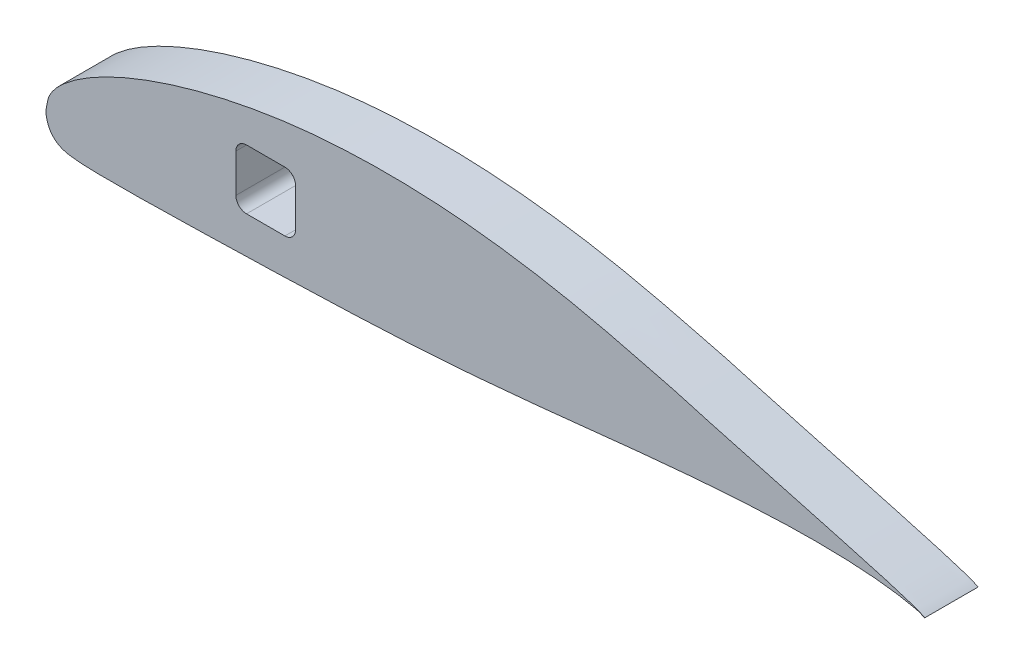
ISO-10303-21;
HEADER;
FILE_DESCRIPTION(('STEP AP214'),'2;1');
FILE_NAME('part.step','',(''),(''),'','','');
FILE_SCHEMA(('AUTOMOTIVE_DESIGN { 1 0 10303 214 1 1 1 1 }'));
ENDSEC;
DATA;
#1=APPLICATION_CONTEXT('core data for automotive mechanical design processes');
#2=APPLICATION_PROTOCOL_DEFINITION('international standard','automotive_design',2000,#1);
#3=PRODUCT_CONTEXT('',#1,'mechanical');
#4=PRODUCT('Part','Part','',(#3));
#5=PRODUCT_RELATED_PRODUCT_CATEGORY('part','',(#4));
#6=PRODUCT_DEFINITION_FORMATION('','',#4);
#7=PRODUCT_DEFINITION_CONTEXT('part definition',#1,'design');
#8=PRODUCT_DEFINITION('design','',#6,#7);
#9=PRODUCT_DEFINITION_SHAPE('','',#8);
#10=(LENGTH_UNIT() NAMED_UNIT(*) SI_UNIT(.MILLI.,.METRE.));
#11=(NAMED_UNIT(*) PLANE_ANGLE_UNIT() SI_UNIT($,.RADIAN.));
#12=(NAMED_UNIT(*) SI_UNIT($,.STERADIAN.) SOLID_ANGLE_UNIT());
#13=UNCERTAINTY_MEASURE_WITH_UNIT(LENGTH_MEASURE(1.E-05),#10,'distance_accuracy_value','');
#14=(GEOMETRIC_REPRESENTATION_CONTEXT(3) GLOBAL_UNCERTAINTY_ASSIGNED_CONTEXT((#13)) GLOBAL_UNIT_ASSIGNED_CONTEXT((#10,
#11,#12)) REPRESENTATION_CONTEXT('',''));
#15=CARTESIAN_POINT('',(0.,0.,0.));
#16=DIRECTION('',(0.,0.,1.));
#17=DIRECTION('',(1.,0.,0.));
#18=AXIS2_PLACEMENT_3D('',#15,#16,#17);
#19=CARTESIAN_POINT('',(113.919,28.5109385218788,25.4));
#20=DIRECTION('',(0.,0.,-1.));
#21=DIRECTION('',(-1.,0.,0.));
#22=AXIS2_PLACEMENT_3D('',#19,#20,#21);
#23=CYLINDRICAL_SURFACE('',#22,5.08);
#24=CARTESIAN_POINT('',(113.919,28.5109385218788,0.));
#25=DIRECTION('',(0.,0.,1.));
#26=DIRECTION('',(1.,0.,0.));
#27=AXIS2_PLACEMENT_3D('',#24,#25,#26);
#28=CIRCLE('',#27,5.08);
#29=CARTESIAN_POINT('',(118.999,28.5109385218788,0.));
#30=VERTEX_POINT('',#29);
#31=CARTESIAN_POINT('',(113.919,33.5909385218788,0.));
#32=VERTEX_POINT('',#31);
#33=EDGE_CURVE('E224',#30,#32,#28,.T.);
#34=ORIENTED_EDGE('',*,*,#33,.F.);
#35=DIRECTION('',(0.,0.,-1.));
#36=VECTOR('',#35,1.);
#37=CARTESIAN_POINT('',(118.999,28.5109385218788,25.4));
#38=LINE('',#37,#36);
#39=CARTESIAN_POINT('',(118.999,28.5109385218788,25.4));
#40=VERTEX_POINT('',#39);
#41=EDGE_CURVE('E12',#40,#30,#38,.T.);
#42=ORIENTED_EDGE('',*,*,#41,.F.);
#43=CARTESIAN_POINT('',(113.919,28.5109385218788,25.4));
#44=DIRECTION('',(0.,0.,1.));
#45=DIRECTION('',(1.,0.,0.));
#46=AXIS2_PLACEMENT_3D('',#43,#44,#45);
#47=CIRCLE('',#46,5.08);
#48=CARTESIAN_POINT('',(113.919,33.5909385218788,25.4));
#49=VERTEX_POINT('',#48);
#50=EDGE_CURVE('E289',#40,#49,#47,.T.);
#51=ORIENTED_EDGE('',*,*,#50,.T.);
#52=DIRECTION('',(0.,0.,-1.));
#53=VECTOR('',#52,1.);
#54=CARTESIAN_POINT('',(113.919,33.5909385218788,25.4));
#55=LINE('',#54,#53);
#56=EDGE_CURVE('E140',#49,#32,#55,.T.);
#57=ORIENTED_EDGE('',*,*,#56,.T.);
#58=EDGE_LOOP('',(#34,#42,#51,#57));
#59=FACE_BOUND('',#58,.T.);
#60=ADVANCED_FACE('F124',(#59),#23,.F.);
#61=CARTESIAN_POINT('',(0.,0.,0.));
#62=DIRECTION('',(0.,0.,1.));
#63=DIRECTION('',(1.,0.,0.));
#64=AXIS2_PLACEMENT_3D('',#61,#62,#63);
#65=PLANE('',#64);
#66=ORIENTED_EDGE('',*,*,#33,.T.);
#67=DIRECTION('',(-1.,0.,0.));
#68=VECTOR('',#67,1.);
#69=CARTESIAN_POINT('',(0.,33.5909385218788,0.));
#70=LINE('',#69,#68);
#71=CARTESIAN_POINT('',(95.631,33.5909385218788,0.));
#72=VERTEX_POINT('',#71);
#73=EDGE_CURVE('E282',#32,#72,#70,.T.);
#74=ORIENTED_EDGE('',*,*,#73,.T.);
#75=CARTESIAN_POINT('',(95.631,28.5109385218788,0.));
#76=DIRECTION('',(0.,0.,1.));
#77=DIRECTION('',(1.,0.,0.));
#78=AXIS2_PLACEMENT_3D('',#75,#76,#77);
#79=CIRCLE('',#78,5.08);
#80=CARTESIAN_POINT('',(90.551,28.5109385218788,0.));
#81=VERTEX_POINT('',#80);
#82=EDGE_CURVE('E280',#72,#81,#79,.T.);
#83=ORIENTED_EDGE('',*,*,#82,.T.);
#84=DIRECTION('',(0.,-1.,0.));
#85=VECTOR('',#84,1.);
#86=CARTESIAN_POINT('',(90.551,0.,0.));
#87=LINE('',#86,#85);
#88=CARTESIAN_POINT('',(90.551,10.2229385218788,0.));
#89=VERTEX_POINT('',#88);
#90=EDGE_CURVE('E195',#81,#89,#87,.T.);
#91=ORIENTED_EDGE('',*,*,#90,.T.);
#92=CARTESIAN_POINT('',(95.631,10.2229385218788,0.));
#93=DIRECTION('',(0.,0.,1.));
#94=DIRECTION('',(1.,0.,0.));
#95=AXIS2_PLACEMENT_3D('',#92,#93,#94);
#96=CIRCLE('',#95,5.08);
#97=CARTESIAN_POINT('',(95.631,5.14293852187881,0.));
#98=VERTEX_POINT('',#97);
#99=EDGE_CURVE('E276',#89,#98,#96,.T.);
#100=ORIENTED_EDGE('',*,*,#99,.T.);
#101=DIRECTION('',(-1.,0.,0.));
#102=VECTOR('',#101,1.);
#103=CARTESIAN_POINT('',(0.,5.14293852187881,0.));
#104=LINE('',#103,#102);
#105=CARTESIAN_POINT('',(113.919,5.14293852187881,0.));
#106=VERTEX_POINT('',#105);
#107=EDGE_CURVE('E271',#106,#98,#104,.T.);
#108=ORIENTED_EDGE('',*,*,#107,.F.);
#109=CARTESIAN_POINT('',(113.919,10.2229385218788,0.));
#110=DIRECTION('',(0.,0.,1.));
#111=DIRECTION('',(1.,0.,0.));
#112=AXIS2_PLACEMENT_3D('',#109,#110,#111);
#113=CIRCLE('',#112,5.08);
#114=CARTESIAN_POINT('',(118.999,10.2229385218788,0.));
#115=VERTEX_POINT('',#114);
#116=EDGE_CURVE('E268',#115,#106,#113,.F.);
#117=ORIENTED_EDGE('',*,*,#116,.F.);
#118=DIRECTION('',(0.,-1.,0.));
#119=VECTOR('',#118,1.);
#120=CARTESIAN_POINT('',(118.999,0.,0.));
#121=LINE('',#120,#119);
#122=EDGE_CURVE('E267',#30,#115,#121,.T.);
#123=ORIENTED_EDGE('',*,*,#122,.F.);
#124=EDGE_LOOP('',(#66,#74,#83,#91,#100,#108,#117,#123));
#125=FACE_BOUND('',#124,.T.);
#126=CARTESIAN_POINT('',(419.1,0.,0.));
#127=CARTESIAN_POINT('',(419.135582715604,0.0308317196044877,0.));
#128=CARTESIAN_POINT('',(415.908005576762,1.68017552922438,0.));
#129=CARTESIAN_POINT('',(413.243760321431,2.45449325102642,0.));
#130=CARTESIAN_POINT('',(409.043286393216,3.88399929072975,0.));
#131=CARTESIAN_POINT('',(404.448084399841,5.26468352260066,0.));
#132=CARTESIAN_POINT('',(399.073048504437,6.84672085309653,0.));
#133=CARTESIAN_POINT('',(393.069943473864,8.55383071372093,0.));
#134=CARTESIAN_POINT('',(386.416537762572,10.4125623702694,0.));
#135=CARTESIAN_POINT('',(379.149346257583,12.4152401973134,0.));
#136=CARTESIAN_POINT('',(371.290373604248,14.5663386528226,0.));
#137=CARTESIAN_POINT('',(362.867607833606,16.8600771410093,0.));
#138=CARTESIAN_POINT('',(353.911264701423,19.2970964213392,0.));
#139=CARTESIAN_POINT('',(344.453150457147,21.8730071850554,0.));
#140=CARTESIAN_POINT('',(334.523432326998,24.5698824655877,0.));
#141=CARTESIAN_POINT('',(324.169303454509,27.4216021936468,0.));
#142=CARTESIAN_POINT('',(313.362731470659,30.2499142733887,0.));
#143=CARTESIAN_POINT('',(302.362905014892,33.694567181203,0.));
#144=CARTESIAN_POINT('',(290.812066152157,36.3225036594668,0.));
#145=CARTESIAN_POINT('',(279.147802785444,39.4898304897028,0.));
#146=CARTESIAN_POINT('',(267.18702760258,42.4092459803584,0.));
#147=CARTESIAN_POINT('',(255.034690470087,45.1684284186771,0.));
#148=CARTESIAN_POINT('',(242.721185390446,47.650209376373,0.));
#149=CARTESIAN_POINT('',(230.296228943543,49.8338945911509,0.));
#150=CARTESIAN_POINT('',(217.801864374593,51.6800065771285,0.));
#151=CARTESIAN_POINT('',(205.28400048705,53.175668630729,0.));
#152=CARTESIAN_POINT('',(192.786307767397,54.3071055161748,0.));
#153=CARTESIAN_POINT('',(180.35248832563,55.0551537512211,0.));
#154=CARTESIAN_POINT('',(168.027001927048,55.4190185344547,0.));
#155=CARTESIAN_POINT('',(155.853682433519,55.4157048874246,0.));
#156=CARTESIAN_POINT('',(143.874848820048,55.0431886057995,0.));
#157=CARTESIAN_POINT('',(132.132886757781,54.3128726201629,0.));
#158=CARTESIAN_POINT('',(120.667074019597,53.2411304735398,0.));
#159=CARTESIAN_POINT('',(109.522615963792,51.8022144959764,0.));
#160=CARTESIAN_POINT('',(98.7372141186955,50.0463241889842,0.));
#161=CARTESIAN_POINT('',(88.3471013961049,48.018984454137,0.));
#162=CARTESIAN_POINT('',(78.3889033747344,45.7522950434563,0.));
#163=CARTESIAN_POINT('',(68.8976027410483,43.2760726247493,0.));
#164=CARTESIAN_POINT('',(59.9067725274482,40.6169839418443,0.));
#165=CARTESIAN_POINT('',(51.4478081121291,37.8028434738782,0.));
#166=CARTESIAN_POINT('',(43.5499195166549,34.8620258650089,0.));
#167=CARTESIAN_POINT('',(36.2412767191211,31.8209315950195,0.));
#168=CARTESIAN_POINT('',(29.5472205514253,28.7079086552229,0.));
#169=CARTESIAN_POINT('',(23.4899755011858,25.5532333371454,0.));
#170=CARTESIAN_POINT('',(18.0911782238622,22.3841442181796,0.));
#171=CARTESIAN_POINT('',(13.3658843805296,19.2305326996037,0.));
#172=CARTESIAN_POINT('',(9.3302502078457,16.1138179845186,0.));
#173=CARTESIAN_POINT('',(5.96985195064272,13.0389997626468,0.));
#174=CARTESIAN_POINT('',(3.34519775435926,9.93858431084437,0.));
#175=CARTESIAN_POINT('',(1.18019279694968,6.53570814186339,0.));
#176=CARTESIAN_POINT('',(0.479614476084666,3.07990840614629,0.));
#177=CARTESIAN_POINT('',(-0.173094538194013,-0.266173519096999,0.));
#178=CARTESIAN_POINT('',(0.240253696731487,-3.33294292892219,0.));
#179=CARTESIAN_POINT('',(1.37823066344816,-6.42381349893486,0.));
#180=CARTESIAN_POINT('',(3.22917605316422,-9.15021189114401,0.));
#181=CARTESIAN_POINT('',(5.89603945867697,-11.3206783893859,0.));
#182=CARTESIAN_POINT('',(9.37076014042797,-12.5914230643237,0.));
#183=CARTESIAN_POINT('',(13.453435798726,-13.2083059619907,0.));
#184=CARTESIAN_POINT('',(18.1779423005279,-13.5437135880216,0.));
#185=CARTESIAN_POINT('',(23.5691170669731,-13.7123319803595,0.));
#186=CARTESIAN_POINT('',(29.6182619801359,-13.823243232534,0.));
#187=CARTESIAN_POINT('',(36.3042180587839,-13.6335103430087,0.));
#188=CARTESIAN_POINT('',(43.6073655350185,-13.7495169210751,0.));
#189=CARTESIAN_POINT('',(51.4990776759717,-13.5704792834039,0.));
#190=CARTESIAN_POINT('',(59.9532183473222,-13.4254465725169,0.));
#191=CARTESIAN_POINT('',(68.9395115321997,-13.2237173628326,0.));
#192=CARTESIAN_POINT('',(78.4265430004961,-12.9981677083409,0.));
#193=CARTESIAN_POINT('',(88.3808800346853,-12.7416794666378,0.));
#194=CARTESIAN_POINT('',(98.7673540895394,-12.4570310641555,0.));
#195=CARTESIAN_POINT('',(109.54948172432,-12.140459652531,0.));
#196=CARTESIAN_POINT('',(120.689292624668,-11.7887582713286,0.));
#197=CARTESIAN_POINT('',(132.147836588957,-11.3961109222143,0.));
#198=CARTESIAN_POINT('',(143.884459540584,-10.9535138146728,0.));
#199=CARTESIAN_POINT('',(155.858263106315,-10.4528030476575,0.));
#200=CARTESIAN_POINT('',(168.027206140478,-9.86999068905553,0.));
#201=CARTESIAN_POINT('',(180.347887972849,-9.165777546511,0.));
#202=CARTESIAN_POINT('',(192.776520036076,-8.32898473292583,0.));
#203=CARTESIAN_POINT('',(205.26997993133,-7.36712520311923,0.));
#204=CARTESIAN_POINT('',(217.78370517201,-6.28359723526979,0.));
#205=CARTESIAN_POINT('',(230.27340567155,-5.08810592291552,0.));
#206=CARTESIAN_POINT('',(242.694431579561,-3.80572861400042,0.));
#207=CARTESIAN_POINT('',(255.00369846204,-2.48473779902352,0.));
#208=CARTESIAN_POINT('',(267.1595145786,-1.18392896216685,0.));
#209=CARTESIAN_POINT('',(279.118910189508,0.0608541103189656,0.));
#210=CARTESIAN_POINT('',(290.839416131453,1.22547415877869,0.));
#211=CARTESIAN_POINT('',(302.279388868877,2.28931437619538,0.));
#212=CARTESIAN_POINT('',(313.398970817434,3.22922123297632,0.));
#213=CARTESIAN_POINT('',(324.158839538699,4.03315524687126,0.));
#214=CARTESIAN_POINT('',(334.521417810108,4.68459136287556,0.));
#215=CARTESIAN_POINT('',(344.449906703923,5.17915941725161,0.));
#216=CARTESIAN_POINT('',(353.909457193007,5.50145282981024,0.));
#217=CARTESIAN_POINT('',(362.866468874944,5.68255660990501,0.));
#218=CARTESIAN_POINT('',(371.289861146006,5.66136185236058,0.));
#219=CARTESIAN_POINT('',(379.150044793554,5.50730755128629,0.));
#220=CARTESIAN_POINT('',(386.41801209807,5.19545299038324,0.));
#221=CARTESIAN_POINT('',(393.072269135646,4.74663009471408,0.));
#222=CARTESIAN_POINT('',(399.076807101172,4.17945925926168,0.));
#223=CARTESIAN_POINT('',(404.450455267835,3.48998403896945,0.));
#224=CARTESIAN_POINT('',(409.051278482858,2.78398441205405,0.));
#225=CARTESIAN_POINT('',(413.236952463653,1.83700723232058,0.));
#226=CARTESIAN_POINT('',(415.921101733839,1.37110704301137,0.));
#227=CARTESIAN_POINT('',(419.065830525278,-0.029607174319721,0.));
#228=CARTESIAN_POINT('',(419.1,0.,0.));
#229=B_SPLINE_CURVE_WITH_KNOTS('',3,(#126,#127,#128,#129,#130,#131,#132,#133,#134,#135,#136,
#137,#138,#139,#140,#141,#142,#143,#144,#145,#146,#147,#148,#149,#150,#151,#152,#153,#154,#155,
#156,#157,#158,#159,#160,#161,#162,#163,#164,#165,#166,#167,#168,#169,#170,#171,#172,#173,#174,
#175,#176,#177,#178,#179,#180,#181,#182,#183,#184,#185,#186,#187,#188,#189,#190,#191,#192,#193,
#194,#195,#196,#197,#198,#199,#200,#201,#202,#203,#204,#205,#206,#207,#208,#209,#210,#211,#212,
#213,#214,#215,#216,#217,#218,#219,#220,#221,#222,#223,#224,#225,#226,#227,#228),.UNSPECIFIED.,
.T.,.F.,(4,1,1,1,1,1,1,1,1,1,1,1,1,1,1,1,1,1,1,1,1,1,1,1,1,1,1,1,1,1,1,1,1,1,1,1,1,1,1,1,1,1,1,
1,1,1,1,1,1,1,1,1,1,1,1,1,1,1,1,1,1,1,1,1,1,1,1,1,1,1,1,1,1,1,1,1,1,1,1,1,1,1,1,1,1,1,1,1,1,1,1,
1,1,1,1,1,1,1,1,1,4),(0.,0.00326326473849562,0.00725055778081695,0.0120517866669423,
0.0176623330327685,0.0240683135255837,0.0312496964611172,0.0391846495195136,0.0478476383038653,
0.0572106956853794,0.0672423330052171,0.0779087597757613,0.0891739845115157,0.100998598535301,
0.113341295445461,0.126157183269471,0.139462308480939,0.15301104004999,0.166927614873976,
0.181081999654676,0.195404479567021,0.209838051098696,0.22433260533195,0.238841948726956,
0.253325072610518,0.267739981910177,0.282048685133404,0.296212776873056,0.310196042923521,
0.323962314217842,0.337476234648746,0.350702494836571,0.363610632106416,0.376163958841249,
0.388325705275646,0.400058825783343,0.411327389676265,0.422098222191528,0.43233946020634,
0.442020270803025,0.451113162537921,0.459592207108775,0.467434958693347,0.474622153537792,
0.481140130111015,0.486983093720853,0.492171114209171,0.496782496001346,0.500970225910245,
0.505871632390465,0.508789423353898,0.512670174112342,0.516325667709443,0.520069901737776,
0.523879651231969,0.52796074283848,0.532641784179838,0.53806925539385,0.544264221299989,
0.551214848194982,0.558899644744671,0.567291448215615,0.576362098792024,0.586079537161936,
0.59640911206805,0.607314709370189,0.618758331538551,0.630699137504577,0.643094929182506,
0.655903572744297,0.669079202119925,0.682576600267353,0.696348372587692,0.710348009169474,
0.724529115657972,0.738844326830719,0.753243364933569,0.767678182352391,0.782097111011908,
0.796448880119002,0.810678262943487,0.824728612910585,0.838547558662397,0.852083943216766,
0.865287848030887,0.878111787127333,0.890511304117214,0.902443005266515,0.913865891429004,
0.924742045614225,0.935035830895632,0.944714495449492,0.953747111862331,0.962105881416277,
0.969765452086777,0.97670305026236,0.982898839006144,0.988333205705569,0.992993711919812,
0.996866342545812,1.),.UNSPECIFIED.);
#230=CARTESIAN_POINT('',(419.1,0.,0.));
#231=VERTEX_POINT('',#230);
#232=EDGE_CURVE('E284',#231,#231,#229,.T.);
#233=ORIENTED_EDGE('',*,*,#232,.F.);
#234=EDGE_LOOP('',(#233));
#235=FACE_BOUND('',#234,.T.);
#236=ADVANCED_FACE('F236',(#125,#235),#65,.F.);
#237=CARTESIAN_POINT('',(118.999,0.,25.4));
#238=DIRECTION('',(1.,0.,0.));
#239=DIRECTION('',(0.,0.,-1.));
#240=AXIS2_PLACEMENT_3D('',#237,#238,#239);
#241=PLANE('',#240);
#242=ORIENTED_EDGE('',*,*,#122,.T.);
#243=DIRECTION('',(0.,0.,-1.));
#244=VECTOR('',#243,1.);
#245=CARTESIAN_POINT('',(118.999,10.2229385218788,25.4));
#246=LINE('',#245,#244);
#247=CARTESIAN_POINT('',(118.999,10.2229385218788,25.4));
#248=VERTEX_POINT('',#247);
#249=EDGE_CURVE('E132',#248,#115,#246,.T.);
#250=ORIENTED_EDGE('',*,*,#249,.F.);
#251=DIRECTION('',(0.,-1.,0.));
#252=VECTOR('',#251,1.);
#253=CARTESIAN_POINT('',(118.999,0.,25.4));
#254=LINE('',#253,#252);
#255=EDGE_CURVE('E311',#40,#248,#254,.T.);
#256=ORIENTED_EDGE('',*,*,#255,.F.);
#257=ORIENTED_EDGE('',*,*,#41,.T.);
#258=EDGE_LOOP('',(#242,#250,#256,#257));
#259=FACE_BOUND('',#258,.T.);
#260=ADVANCED_FACE('F254',(#259),#241,.F.);
#261=CARTESIAN_POINT('',(113.919,10.2229385218788,25.4));
#262=DIRECTION('',(0.,0.,-1.));
#263=DIRECTION('',(-1.,0.,0.));
#264=AXIS2_PLACEMENT_3D('',#261,#262,#263);
#265=CYLINDRICAL_SURFACE('',#264,5.08);
#266=ORIENTED_EDGE('',*,*,#116,.T.);
#267=DIRECTION('',(0.,0.,-1.));
#268=VECTOR('',#267,1.);
#269=CARTESIAN_POINT('',(113.919,5.14293852187881,25.4));
#270=LINE('',#269,#268);
#271=CARTESIAN_POINT('',(113.919,5.14293852187881,25.4));
#272=VERTEX_POINT('',#271);
#273=EDGE_CURVE('E298',#272,#106,#270,.T.);
#274=ORIENTED_EDGE('',*,*,#273,.F.);
#275=CARTESIAN_POINT('',(113.919,10.2229385218788,25.4));
#276=DIRECTION('',(0.,0.,1.));
#277=DIRECTION('',(1.,0.,0.));
#278=AXIS2_PLACEMENT_3D('',#275,#276,#277);
#279=CIRCLE('',#278,5.08);
#280=EDGE_CURVE('E303',#248,#272,#279,.F.);
#281=ORIENTED_EDGE('',*,*,#280,.F.);
#282=ORIENTED_EDGE('',*,*,#249,.T.);
#283=EDGE_LOOP('',(#266,#274,#281,#282));
#284=FACE_BOUND('',#283,.T.);
#285=ADVANCED_FACE('F251',(#284),#265,.F.);
#286=CARTESIAN_POINT('',(0.,5.14293852187881,25.4));
#287=DIRECTION('',(0.,-1.,0.));
#288=DIRECTION('',(1.,0.,0.));
#289=AXIS2_PLACEMENT_3D('',#286,#287,#288);
#290=PLANE('',#289);
#291=ORIENTED_EDGE('',*,*,#107,.T.);
#292=DIRECTION('',(0.,0.,-1.));
#293=VECTOR('',#292,1.);
#294=CARTESIAN_POINT('',(95.631,5.14293852187881,25.4));
#295=LINE('',#294,#293);
#296=CARTESIAN_POINT('',(95.631,5.14293852187881,25.4));
#297=VERTEX_POINT('',#296);
#298=EDGE_CURVE('E296',#297,#98,#295,.T.);
#299=ORIENTED_EDGE('',*,*,#298,.F.);
#300=DIRECTION('',(-1.,0.,0.));
#301=VECTOR('',#300,1.);
#302=CARTESIAN_POINT('',(0.,5.14293852187881,25.4));
#303=LINE('',#302,#301);
#304=EDGE_CURVE('E309',#272,#297,#303,.T.);
#305=ORIENTED_EDGE('',*,*,#304,.F.);
#306=ORIENTED_EDGE('',*,*,#273,.T.);
#307=EDGE_LOOP('',(#291,#299,#305,#306));
#308=FACE_BOUND('',#307,.T.);
#309=ADVANCED_FACE('F247',(#308),#290,.F.);
#310=CARTESIAN_POINT('',(95.631,10.2229385218788,25.4));
#311=DIRECTION('',(0.,0.,-1.));
#312=DIRECTION('',(-1.,0.,0.));
#313=AXIS2_PLACEMENT_3D('',#310,#311,#312);
#314=CYLINDRICAL_SURFACE('',#313,5.08);
#315=ORIENTED_EDGE('',*,*,#99,.F.);
#316=DIRECTION('',(0.,0.,-1.));
#317=VECTOR('',#316,1.);
#318=CARTESIAN_POINT('',(90.551,10.2229385218788,25.4));
#319=LINE('',#318,#317);
#320=CARTESIAN_POINT('',(90.551,10.2229385218788,25.4));
#321=VERTEX_POINT('',#320);
#322=EDGE_CURVE('E199',#321,#89,#319,.T.);
#323=ORIENTED_EDGE('',*,*,#322,.F.);
#324=CARTESIAN_POINT('',(95.631,10.2229385218788,25.4));
#325=DIRECTION('',(0.,0.,1.));
#326=DIRECTION('',(1.,0.,0.));
#327=AXIS2_PLACEMENT_3D('',#324,#325,#326);
#328=CIRCLE('',#327,5.08);
#329=EDGE_CURVE('E210',#321,#297,#328,.T.);
#330=ORIENTED_EDGE('',*,*,#329,.T.);
#331=ORIENTED_EDGE('',*,*,#298,.T.);
#332=EDGE_LOOP('',(#315,#323,#330,#331));
#333=FACE_BOUND('',#332,.T.);
#334=ADVANCED_FACE('F244',(#333),#314,.F.);
#335=CARTESIAN_POINT('',(90.551,0.,25.4));
#336=DIRECTION('',(1.,0.,0.));
#337=DIRECTION('',(0.,0.,-1.));
#338=AXIS2_PLACEMENT_3D('',#335,#336,#337);
#339=PLANE('',#338);
#340=ORIENTED_EDGE('',*,*,#90,.F.);
#341=DIRECTION('',(0.,0.,-1.));
#342=VECTOR('',#341,1.);
#343=CARTESIAN_POINT('',(90.551,28.5109385218788,25.4));
#344=LINE('',#343,#342);
#345=CARTESIAN_POINT('',(90.551,28.5109385218788,25.4));
#346=VERTEX_POINT('',#345);
#347=EDGE_CURVE('E190',#346,#81,#344,.T.);
#348=ORIENTED_EDGE('',*,*,#347,.F.);
#349=DIRECTION('',(0.,-1.,0.));
#350=VECTOR('',#349,1.);
#351=CARTESIAN_POINT('',(90.551,0.,25.4));
#352=LINE('',#351,#350);
#353=EDGE_CURVE('E193',#346,#321,#352,.T.);
#354=ORIENTED_EDGE('',*,*,#353,.T.);
#355=ORIENTED_EDGE('',*,*,#322,.T.);
#356=EDGE_LOOP('',(#340,#348,#354,#355));
#357=FACE_BOUND('',#356,.T.);
#358=ADVANCED_FACE('F192',(#357),#339,.T.);
#359=CARTESIAN_POINT('',(95.631,28.5109385218788,25.4));
#360=DIRECTION('',(0.,0.,-1.));
#361=DIRECTION('',(-1.,0.,0.));
#362=AXIS2_PLACEMENT_3D('',#359,#360,#361);
#363=CYLINDRICAL_SURFACE('',#362,5.08);
#364=ORIENTED_EDGE('',*,*,#82,.F.);
#365=DIRECTION('',(0.,0.,-1.));
#366=VECTOR('',#365,1.);
#367=CARTESIAN_POINT('',(95.631,33.5909385218788,25.4));
#368=LINE('',#367,#366);
#369=CARTESIAN_POINT('',(95.631,33.5909385218788,25.4));
#370=VERTEX_POINT('',#369);
#371=EDGE_CURVE('E165',#370,#72,#368,.T.);
#372=ORIENTED_EDGE('',*,*,#371,.F.);
#373=CARTESIAN_POINT('',(95.631,28.5109385218788,25.4));
#374=DIRECTION('',(0.,0.,1.));
#375=DIRECTION('',(1.,0.,0.));
#376=AXIS2_PLACEMENT_3D('',#373,#374,#375);
#377=CIRCLE('',#376,5.08);
#378=EDGE_CURVE('E208',#370,#346,#377,.T.);
#379=ORIENTED_EDGE('',*,*,#378,.T.);
#380=ORIENTED_EDGE('',*,*,#347,.T.);
#381=EDGE_LOOP('',(#364,#372,#379,#380));
#382=FACE_BOUND('',#381,.T.);
#383=ADVANCED_FACE('F212',(#382),#363,.F.);
#384=CARTESIAN_POINT('',(0.,33.5909385218788,25.4));
#385=DIRECTION('',(0.,-1.,0.));
#386=DIRECTION('',(0.,0.,-1.));
#387=AXIS2_PLACEMENT_3D('',#384,#385,#386);
#388=PLANE('',#387);
#389=ORIENTED_EDGE('',*,*,#73,.F.);
#390=ORIENTED_EDGE('',*,*,#56,.F.);
#391=DIRECTION('',(-1.,0.,0.));
#392=VECTOR('',#391,1.);
#393=CARTESIAN_POINT('',(0.,33.5909385218788,25.4));
#394=LINE('',#393,#392);
#395=EDGE_CURVE('E213',#49,#370,#394,.T.);
#396=ORIENTED_EDGE('',*,*,#395,.T.);
#397=ORIENTED_EDGE('',*,*,#371,.T.);
#398=EDGE_LOOP('',(#389,#390,#396,#397));
#399=FACE_BOUND('',#398,.T.);
#400=ADVANCED_FACE('F234',(#399),#388,.T.);
#401=CARTESIAN_POINT('',(419.1,0.,25.4));
#402=CARTESIAN_POINT('',(419.135582715604,0.0308317196044877,25.4));
#403=CARTESIAN_POINT('',(415.908005576762,1.68017552922438,25.4));
#404=CARTESIAN_POINT('',(413.243760321431,2.45449325102642,25.4));
#405=CARTESIAN_POINT('',(409.043286393216,3.88399929072975,25.4));
#406=CARTESIAN_POINT('',(404.448084399841,5.26468352260066,25.4));
#407=CARTESIAN_POINT('',(399.073048504437,6.84672085309653,25.4));
#408=CARTESIAN_POINT('',(393.069943473864,8.55383071372093,25.4));
#409=CARTESIAN_POINT('',(386.416537762572,10.4125623702694,25.4));
#410=CARTESIAN_POINT('',(379.149346257583,12.4152401973134,25.4));
#411=CARTESIAN_POINT('',(371.290373604248,14.5663386528226,25.4));
#412=CARTESIAN_POINT('',(362.867607833606,16.8600771410093,25.4));
#413=CARTESIAN_POINT('',(353.911264701423,19.2970964213392,25.4));
#414=CARTESIAN_POINT('',(344.453150457147,21.8730071850554,25.4));
#415=CARTESIAN_POINT('',(334.523432326998,24.5698824655877,25.4));
#416=CARTESIAN_POINT('',(324.169303454509,27.4216021936468,25.4));
#417=CARTESIAN_POINT('',(313.362731470659,30.2499142733887,25.4));
#418=CARTESIAN_POINT('',(302.362905014892,33.694567181203,25.4));
#419=CARTESIAN_POINT('',(290.812066152157,36.3225036594668,25.4));
#420=CARTESIAN_POINT('',(279.147802785444,39.4898304897028,25.4));
#421=CARTESIAN_POINT('',(267.18702760258,42.4092459803584,25.4));
#422=CARTESIAN_POINT('',(255.034690470087,45.1684284186771,25.4));
#423=CARTESIAN_POINT('',(242.721185390446,47.650209376373,25.4));
#424=CARTESIAN_POINT('',(230.296228943543,49.8338945911509,25.4));
#425=CARTESIAN_POINT('',(217.801864374593,51.6800065771285,25.4));
#426=CARTESIAN_POINT('',(205.28400048705,53.175668630729,25.4));
#427=CARTESIAN_POINT('',(192.786307767397,54.3071055161748,25.4));
#428=CARTESIAN_POINT('',(180.35248832563,55.0551537512211,25.4));
#429=CARTESIAN_POINT('',(168.027001927048,55.4190185344547,25.4));
#430=CARTESIAN_POINT('',(155.853682433519,55.4157048874246,25.4));
#431=CARTESIAN_POINT('',(143.874848820048,55.0431886057995,25.4));
#432=CARTESIAN_POINT('',(132.132886757781,54.3128726201629,25.4));
#433=CARTESIAN_POINT('',(120.667074019597,53.2411304735398,25.4));
#434=CARTESIAN_POINT('',(109.522615963792,51.8022144959764,25.4));
#435=CARTESIAN_POINT('',(98.7372141186955,50.0463241889842,25.4));
#436=CARTESIAN_POINT('',(88.3471013961049,48.018984454137,25.4));
#437=CARTESIAN_POINT('',(78.3889033747344,45.7522950434563,25.4));
#438=CARTESIAN_POINT('',(68.8976027410483,43.2760726247493,25.4));
#439=CARTESIAN_POINT('',(59.9067725274482,40.6169839418443,25.4));
#440=CARTESIAN_POINT('',(51.4478081121291,37.8028434738782,25.4));
#441=CARTESIAN_POINT('',(43.5499195166549,34.8620258650089,25.4));
#442=CARTESIAN_POINT('',(36.2412767191211,31.8209315950195,25.4));
#443=CARTESIAN_POINT('',(29.5472205514253,28.7079086552229,25.4));
#444=CARTESIAN_POINT('',(23.4899755011858,25.5532333371454,25.4));
#445=CARTESIAN_POINT('',(18.0911782238622,22.3841442181796,25.4));
#446=CARTESIAN_POINT('',(13.3658843805296,19.2305326996037,25.4));
#447=CARTESIAN_POINT('',(9.3302502078457,16.1138179845186,25.4));
#448=CARTESIAN_POINT('',(5.96985195064272,13.0389997626468,25.4));
#449=CARTESIAN_POINT('',(3.34519775435926,9.93858431084437,25.4));
#450=CARTESIAN_POINT('',(1.18019279694968,6.53570814186339,25.4));
#451=CARTESIAN_POINT('',(0.479614476084666,3.07990840614629,25.4));
#452=CARTESIAN_POINT('',(-0.173094538194013,-0.266173519096999,25.4));
#453=CARTESIAN_POINT('',(0.240253696731487,-3.33294292892219,25.4));
#454=CARTESIAN_POINT('',(1.37823066344816,-6.42381349893486,25.4));
#455=CARTESIAN_POINT('',(3.22917605316422,-9.15021189114401,25.4));
#456=CARTESIAN_POINT('',(5.89603945867697,-11.3206783893859,25.4));
#457=CARTESIAN_POINT('',(9.37076014042797,-12.5914230643237,25.4));
#458=CARTESIAN_POINT('',(13.453435798726,-13.2083059619907,25.4));
#459=CARTESIAN_POINT('',(18.1779423005279,-13.5437135880216,25.4));
#460=CARTESIAN_POINT('',(23.5691170669731,-13.7123319803595,25.4));
#461=CARTESIAN_POINT('',(29.6182619801359,-13.823243232534,25.4));
#462=CARTESIAN_POINT('',(36.3042180587839,-13.6335103430087,25.4));
#463=CARTESIAN_POINT('',(43.6073655350185,-13.7495169210751,25.4));
#464=CARTESIAN_POINT('',(51.4990776759717,-13.5704792834039,25.4));
#465=CARTESIAN_POINT('',(59.9532183473222,-13.4254465725169,25.4));
#466=CARTESIAN_POINT('',(68.9395115321997,-13.2237173628326,25.4));
#467=CARTESIAN_POINT('',(78.4265430004961,-12.9981677083409,25.4));
#468=CARTESIAN_POINT('',(88.3808800346853,-12.7416794666378,25.4));
#469=CARTESIAN_POINT('',(98.7673540895394,-12.4570310641555,25.4));
#470=CARTESIAN_POINT('',(109.54948172432,-12.140459652531,25.4));
#471=CARTESIAN_POINT('',(120.689292624668,-11.7887582713286,25.4));
#472=CARTESIAN_POINT('',(132.147836588957,-11.3961109222143,25.4));
#473=CARTESIAN_POINT('',(143.884459540584,-10.9535138146728,25.4));
#474=CARTESIAN_POINT('',(155.858263106315,-10.4528030476575,25.4));
#475=CARTESIAN_POINT('',(168.027206140478,-9.86999068905553,25.4));
#476=CARTESIAN_POINT('',(180.347887972849,-9.165777546511,25.4));
#477=CARTESIAN_POINT('',(192.776520036076,-8.32898473292583,25.4));
#478=CARTESIAN_POINT('',(205.26997993133,-7.36712520311923,25.4));
#479=CARTESIAN_POINT('',(217.78370517201,-6.28359723526979,25.4));
#480=CARTESIAN_POINT('',(230.27340567155,-5.08810592291552,25.4));
#481=CARTESIAN_POINT('',(242.694431579561,-3.80572861400042,25.4));
#482=CARTESIAN_POINT('',(255.00369846204,-2.48473779902352,25.4));
#483=CARTESIAN_POINT('',(267.1595145786,-1.18392896216685,25.4));
#484=CARTESIAN_POINT('',(279.118910189508,0.0608541103189656,25.4));
#485=CARTESIAN_POINT('',(290.839416131453,1.22547415877869,25.4));
#486=CARTESIAN_POINT('',(302.279388868877,2.28931437619538,25.4));
#487=CARTESIAN_POINT('',(313.398970817434,3.22922123297632,25.4));
#488=CARTESIAN_POINT('',(324.158839538699,4.03315524687126,25.4));
#489=CARTESIAN_POINT('',(334.521417810108,4.68459136287556,25.4));
#490=CARTESIAN_POINT('',(344.449906703923,5.17915941725161,25.4));
#491=CARTESIAN_POINT('',(353.909457193007,5.50145282981024,25.4));
#492=CARTESIAN_POINT('',(362.866468874944,5.68255660990501,25.4));
#493=CARTESIAN_POINT('',(371.289861146006,5.66136185236058,25.4));
#494=CARTESIAN_POINT('',(379.150044793554,5.50730755128629,25.4));
#495=CARTESIAN_POINT('',(386.41801209807,5.19545299038324,25.4));
#496=CARTESIAN_POINT('',(393.072269135646,4.74663009471408,25.4));
#497=CARTESIAN_POINT('',(399.076807101172,4.17945925926168,25.4));
#498=CARTESIAN_POINT('',(404.450455267835,3.48998403896945,25.4));
#499=CARTESIAN_POINT('',(409.051278482858,2.78398441205405,25.4));
#500=CARTESIAN_POINT('',(413.236952463653,1.83700723232058,25.4));
#501=CARTESIAN_POINT('',(415.921101733839,1.37110704301137,25.4));
#502=CARTESIAN_POINT('',(419.065830525278,-0.029607174319721,25.4));
#503=CARTESIAN_POINT('',(419.1,0.,25.4));
#504=B_SPLINE_CURVE_WITH_KNOTS('',3,(#401,#402,#403,#404,#405,#406,#407,#408,#409,#410,#411,
#412,#413,#414,#415,#416,#417,#418,#419,#420,#421,#422,#423,#424,#425,#426,#427,#428,#429,#430,
#431,#432,#433,#434,#435,#436,#437,#438,#439,#440,#441,#442,#443,#444,#445,#446,#447,#448,#449,
#450,#451,#452,#453,#454,#455,#456,#457,#458,#459,#460,#461,#462,#463,#464,#465,#466,#467,#468,
#469,#470,#471,#472,#473,#474,#475,#476,#477,#478,#479,#480,#481,#482,#483,#484,#485,#486,#487,
#488,#489,#490,#491,#492,#493,#494,#495,#496,#497,#498,#499,#500,#501,#502,#503),.UNSPECIFIED.,
.T.,.F.,(4,1,1,1,1,1,1,1,1,1,1,1,1,1,1,1,1,1,1,1,1,1,1,1,1,1,1,1,1,1,1,1,1,1,1,1,1,1,1,1,1,1,1,
1,1,1,1,1,1,1,1,1,1,1,1,1,1,1,1,1,1,1,1,1,1,1,1,1,1,1,1,1,1,1,1,1,1,1,1,1,1,1,1,1,1,1,1,1,1,1,1,
1,1,1,1,1,1,1,1,1,4),(0.,0.00326326473849562,0.00725055778081695,0.0120517866669423,
0.0176623330327685,0.0240683135255837,0.0312496964611172,0.0391846495195136,0.0478476383038653,
0.0572106956853794,0.0672423330052171,0.0779087597757613,0.0891739845115157,0.100998598535301,
0.113341295445461,0.126157183269471,0.139462308480939,0.15301104004999,0.166927614873976,
0.181081999654676,0.195404479567021,0.209838051098696,0.22433260533195,0.238841948726956,
0.253325072610518,0.267739981910177,0.282048685133404,0.296212776873056,0.310196042923521,
0.323962314217842,0.337476234648746,0.350702494836571,0.363610632106416,0.376163958841249,
0.388325705275646,0.400058825783343,0.411327389676265,0.422098222191528,0.43233946020634,
0.442020270803025,0.451113162537921,0.459592207108775,0.467434958693347,0.474622153537792,
0.481140130111015,0.486983093720853,0.492171114209171,0.496782496001346,0.500970225910245,
0.505871632390465,0.508789423353898,0.512670174112342,0.516325667709443,0.520069901737776,
0.523879651231969,0.52796074283848,0.532641784179838,0.53806925539385,0.544264221299989,
0.551214848194982,0.558899644744671,0.567291448215615,0.576362098792024,0.586079537161936,
0.59640911206805,0.607314709370189,0.618758331538551,0.630699137504577,0.643094929182506,
0.655903572744297,0.669079202119925,0.682576600267353,0.696348372587692,0.710348009169474,
0.724529115657972,0.738844326830719,0.753243364933569,0.767678182352391,0.782097111011908,
0.796448880119002,0.810678262943487,0.824728612910585,0.838547558662397,0.852083943216766,
0.865287848030887,0.878111787127333,0.890511304117214,0.902443005266515,0.913865891429004,
0.924742045614225,0.935035830895632,0.944714495449492,0.953747111862331,0.962105881416277,
0.969765452086777,0.97670305026236,0.982898839006144,0.988333205705569,0.992993711919812,
0.996866342545812,1.),.UNSPECIFIED.);
#505=DIRECTION('',(0.,0.,-1.));
#506=VECTOR('',#505,1.);
#507=SURFACE_OF_LINEAR_EXTRUSION('',#504,#506);
#508=ORIENTED_EDGE('',*,*,#232,.T.);
#509=EDGE_LOOP('',(#508));
#510=FACE_BOUND('',#509,.T.);
#511=CARTESIAN_POINT('',(419.1,0.,25.4));
#512=VERTEX_POINT('',#511);
#513=EDGE_CURVE('E215',#512,#512,#504,.T.);
#514=ORIENTED_EDGE('',*,*,#513,.F.);
#515=EDGE_LOOP('',(#514));
#516=FACE_BOUND('',#515,.T.);
#517=ADVANCED_FACE('F230',(#510,#516),#507,.F.);
#518=CARTESIAN_POINT('',(0.,0.,25.4));
#519=DIRECTION('',(0.,0.,1.));
#520=DIRECTION('',(1.,0.,0.));
#521=AXIS2_PLACEMENT_3D('',#518,#519,#520);
#522=PLANE('',#521);
#523=ORIENTED_EDGE('',*,*,#50,.F.);
#524=ORIENTED_EDGE('',*,*,#255,.T.);
#525=ORIENTED_EDGE('',*,*,#280,.T.);
#526=ORIENTED_EDGE('',*,*,#304,.T.);
#527=ORIENTED_EDGE('',*,*,#329,.F.);
#528=ORIENTED_EDGE('',*,*,#353,.F.);
#529=ORIENTED_EDGE('',*,*,#378,.F.);
#530=ORIENTED_EDGE('',*,*,#395,.F.);
#531=EDGE_LOOP('',(#523,#524,#525,#526,#527,#528,#529,#530));
#532=FACE_BOUND('',#531,.T.);
#533=ORIENTED_EDGE('',*,*,#513,.T.);
#534=EDGE_LOOP('',(#533));
#535=FACE_BOUND('',#534,.T.);
#536=ADVANCED_FACE('F205',(#532,#535),#522,.T.);
#537=CLOSED_SHELL('',(#60,#236,#260,#285,#309,#334,#358,#383,#400,#517,#536));
#538=MANIFOLD_SOLID_BREP('B2',#537);
#539=ADVANCED_BREP_SHAPE_REPRESENTATION('',(#18,#538),#14);
#540=SHAPE_DEFINITION_REPRESENTATION(#9,#539);
ENDSEC;
END-ISO-10303-21;
